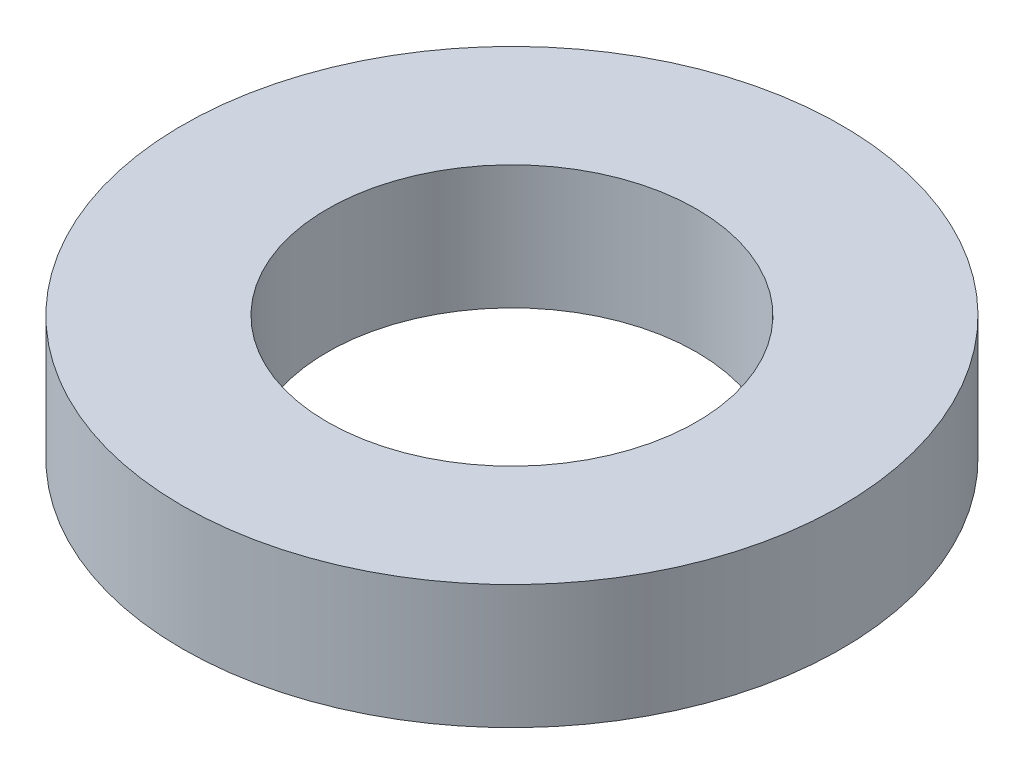
ISO-10303-21;
HEADER;
FILE_DESCRIPTION(('STEP AP214'),'2;1');
FILE_NAME('part.step','',(''),(''),'','','');
FILE_SCHEMA(('AUTOMOTIVE_DESIGN { 1 0 10303 214 1 1 1 1 }'));
ENDSEC;
DATA;
#1=APPLICATION_CONTEXT('core data for automotive mechanical design processes');
#2=APPLICATION_PROTOCOL_DEFINITION('international standard','automotive_design',2000,#1);
#3=PRODUCT_CONTEXT('',#1,'mechanical');
#4=PRODUCT('Part','Part','',(#3));
#5=PRODUCT_RELATED_PRODUCT_CATEGORY('part','',(#4));
#6=PRODUCT_DEFINITION_FORMATION('','',#4);
#7=PRODUCT_DEFINITION_CONTEXT('part definition',#1,'design');
#8=PRODUCT_DEFINITION('design','',#6,#7);
#9=PRODUCT_DEFINITION_SHAPE('','',#8);
#10=(LENGTH_UNIT() NAMED_UNIT(*) SI_UNIT(.MILLI.,.METRE.));
#11=(NAMED_UNIT(*) PLANE_ANGLE_UNIT() SI_UNIT($,.RADIAN.));
#12=(NAMED_UNIT(*) SI_UNIT($,.STERADIAN.) SOLID_ANGLE_UNIT());
#13=UNCERTAINTY_MEASURE_WITH_UNIT(LENGTH_MEASURE(1.E-05),#10,'distance_accuracy_value','');
#14=(GEOMETRIC_REPRESENTATION_CONTEXT(3) GLOBAL_UNCERTAINTY_ASSIGNED_CONTEXT((#13)) GLOBAL_UNIT_ASSIGNED_CONTEXT((#10,
#11,#12)) REPRESENTATION_CONTEXT('',''));
#15=CARTESIAN_POINT('',(0.,0.,0.));
#16=DIRECTION('',(0.,0.,1.));
#17=DIRECTION('',(1.,0.,0.));
#18=AXIS2_PLACEMENT_3D('',#15,#16,#17);
#19=CARTESIAN_POINT('',(0.,1.1938,0.));
#20=DIRECTION('',(0.,-1.,0.));
#21=DIRECTION('',(0.,0.,-1.));
#22=AXIS2_PLACEMENT_3D('',#19,#20,#21);
#23=CYLINDRICAL_SURFACE('',#22,3.175);
#24=CARTESIAN_POINT('',(0.,1.1938,0.));
#25=DIRECTION('',(0.,1.,0.));
#26=DIRECTION('',(0.,0.,1.));
#27=AXIS2_PLACEMENT_3D('',#24,#25,#26);
#28=CIRCLE('',#27,3.175);
#29=CARTESIAN_POINT('',(0.,1.1938,3.175));
#30=VERTEX_POINT('',#29);
#31=EDGE_CURVE('E10',#30,#30,#28,.T.);
#32=ORIENTED_EDGE('',*,*,#31,.F.);
#33=EDGE_LOOP('',(#32));
#34=FACE_BOUND('',#33,.T.);
#35=CARTESIAN_POINT('',(0.,0.,0.));
#36=DIRECTION('',(0.,1.,0.));
#37=DIRECTION('',(0.,0.,1.));
#38=AXIS2_PLACEMENT_3D('',#35,#36,#37);
#39=CIRCLE('',#38,3.175);
#40=CARTESIAN_POINT('',(0.,0.,3.175));
#41=VERTEX_POINT('',#40);
#42=EDGE_CURVE('E35',#41,#41,#39,.T.);
#43=ORIENTED_EDGE('',*,*,#42,.T.);
#44=EDGE_LOOP('',(#43));
#45=FACE_BOUND('',#44,.T.);
#46=ADVANCED_FACE('F29',(#34,#45),#23,.T.);
#47=CARTESIAN_POINT('',(0.,1.1938,0.));
#48=DIRECTION('',(0.,1.,0.));
#49=DIRECTION('',(0.,0.,1.));
#50=AXIS2_PLACEMENT_3D('',#47,#48,#49);
#51=PLANE('',#50);
#52=CARTESIAN_POINT('',(0.,1.1938,0.));
#53=DIRECTION('',(0.,1.,0.));
#54=DIRECTION('',(0.,0.,1.));
#55=AXIS2_PLACEMENT_3D('',#52,#53,#54);
#56=CIRCLE('',#55,1.778);
#57=CARTESIAN_POINT('',(0.,1.1938,1.778));
#58=VERTEX_POINT('',#57);
#59=EDGE_CURVE('E43',#58,#58,#56,.T.);
#60=ORIENTED_EDGE('',*,*,#59,.F.);
#61=EDGE_LOOP('',(#60));
#62=FACE_BOUND('',#61,.T.);
#63=ORIENTED_EDGE('',*,*,#31,.T.);
#64=EDGE_LOOP('',(#63));
#65=FACE_BOUND('',#64,.T.);
#66=ADVANCED_FACE('F51',(#62,#65),#51,.T.);
#67=CARTESIAN_POINT('',(0.,0.,0.));
#68=DIRECTION('',(0.,1.,0.));
#69=DIRECTION('',(0.,0.,1.));
#70=AXIS2_PLACEMENT_3D('',#67,#68,#69);
#71=PLANE('',#70);
#72=CARTESIAN_POINT('',(0.,0.,0.));
#73=DIRECTION('',(0.,1.,0.));
#74=DIRECTION('',(0.,0.,1.));
#75=AXIS2_PLACEMENT_3D('',#72,#73,#74);
#76=CIRCLE('',#75,1.778);
#77=CARTESIAN_POINT('',(0.,0.,1.778));
#78=VERTEX_POINT('',#77);
#79=EDGE_CURVE('E39',#78,#78,#76,.T.);
#80=ORIENTED_EDGE('',*,*,#79,.T.);
#81=EDGE_LOOP('',(#80));
#82=FACE_BOUND('',#81,.T.);
#83=ORIENTED_EDGE('',*,*,#42,.F.);
#84=EDGE_LOOP('',(#83));
#85=FACE_BOUND('',#84,.T.);
#86=ADVANCED_FACE('F53',(#82,#85),#71,.F.);
#87=CARTESIAN_POINT('',(0.,0.,0.));
#88=DIRECTION('',(0.,1.,0.));
#89=DIRECTION('',(0.,0.,1.));
#90=AXIS2_PLACEMENT_3D('',#87,#88,#89);
#91=CYLINDRICAL_SURFACE('',#90,1.778);
#92=ORIENTED_EDGE('',*,*,#79,.F.);
#93=EDGE_LOOP('',(#92));
#94=FACE_BOUND('',#93,.T.);
#95=ORIENTED_EDGE('',*,*,#59,.T.);
#96=EDGE_LOOP('',(#95));
#97=FACE_BOUND('',#96,.T.);
#98=ADVANCED_FACE('F49',(#94,#97),#91,.F.);
#99=CLOSED_SHELL('',(#46,#66,#86,#98));
#100=MANIFOLD_SOLID_BREP('B2',#99);
#101=ADVANCED_BREP_SHAPE_REPRESENTATION('',(#18,#100),#14);
#102=SHAPE_DEFINITION_REPRESENTATION(#9,#101);
ENDSEC;
END-ISO-10303-21;
